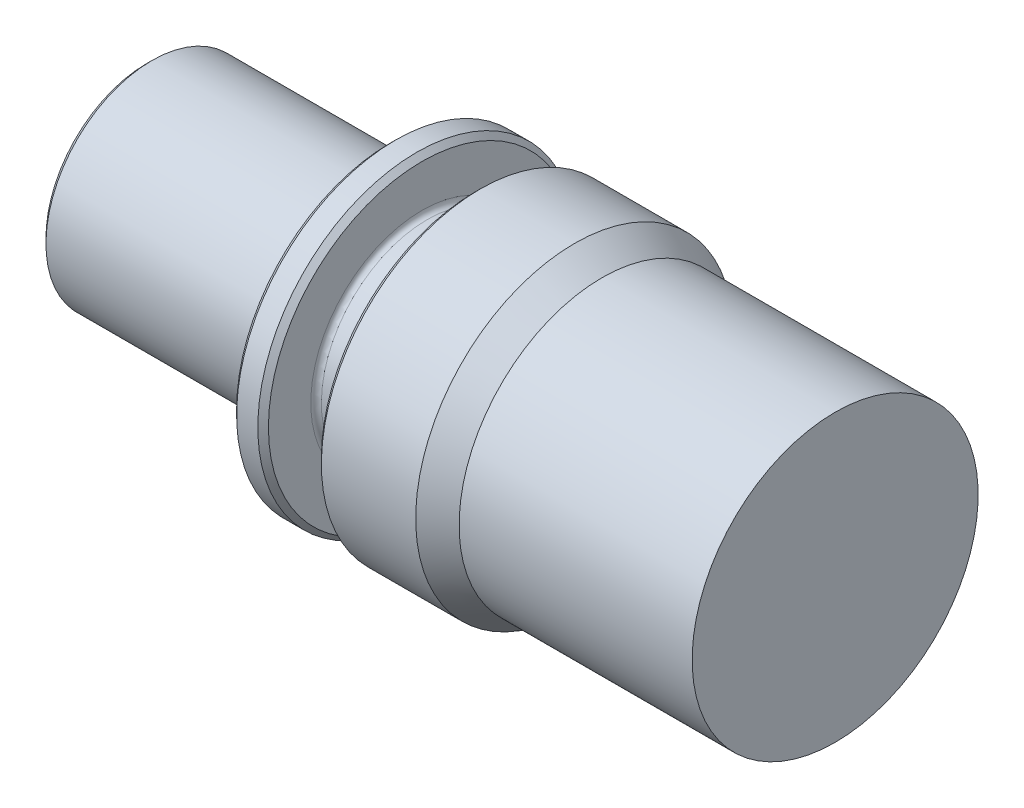
ISO-10303-21;
HEADER;
FILE_DESCRIPTION(('STEP AP214'),'2;1');
FILE_NAME('part.step','',(''),(''),'','','');
FILE_SCHEMA(('AUTOMOTIVE_DESIGN { 1 0 10303 214 1 1 1 1 }'));
ENDSEC;
DATA;
#1=APPLICATION_CONTEXT('core data for automotive mechanical design processes');
#2=APPLICATION_PROTOCOL_DEFINITION('international standard','automotive_design',2000,#1);
#3=PRODUCT_CONTEXT('',#1,'mechanical');
#4=PRODUCT('Part','Part','',(#3));
#5=PRODUCT_RELATED_PRODUCT_CATEGORY('part','',(#4));
#6=PRODUCT_DEFINITION_FORMATION('','',#4);
#7=PRODUCT_DEFINITION_CONTEXT('part definition',#1,'design');
#8=PRODUCT_DEFINITION('design','',#6,#7);
#9=PRODUCT_DEFINITION_SHAPE('','',#8);
#10=(LENGTH_UNIT() NAMED_UNIT(*) SI_UNIT(.MILLI.,.METRE.));
#11=(NAMED_UNIT(*) PLANE_ANGLE_UNIT() SI_UNIT($,.RADIAN.));
#12=(NAMED_UNIT(*) SI_UNIT($,.STERADIAN.) SOLID_ANGLE_UNIT());
#13=UNCERTAINTY_MEASURE_WITH_UNIT(LENGTH_MEASURE(1.E-05),#10,'distance_accuracy_value','');
#14=(GEOMETRIC_REPRESENTATION_CONTEXT(3) GLOBAL_UNCERTAINTY_ASSIGNED_CONTEXT((#13)) GLOBAL_UNIT_ASSIGNED_CONTEXT((#10,
#11,#12)) REPRESENTATION_CONTEXT('',''));
#15=CARTESIAN_POINT('',(0.,0.,0.));
#16=DIRECTION('',(0.,0.,1.));
#17=DIRECTION('',(1.,0.,0.));
#18=AXIS2_PLACEMENT_3D('',#15,#16,#17);
#19=CARTESIAN_POINT('',(28.,7.13999999999999,-7.14));
#20=DIRECTION('',(1.,0.,0.));
#21=DIRECTION('',(0.,0.,1.));
#22=AXIS2_PLACEMENT_3D('',#19,#20,#21);
#23=PLANE('',#22);
#24=CARTESIAN_POINT('',(28.,0.,0.));
#25=DIRECTION('',(1.,0.,0.));
#26=DIRECTION('',(0.,1.,0.));
#27=AXIS2_PLACEMENT_3D('',#24,#25,#26);
#28=CIRCLE('',#27,7.);
#29=CARTESIAN_POINT('',(28.,6.99999999999999,0.));
#30=VERTEX_POINT('',#29);
#31=EDGE_CURVE('E19',#30,#30,#28,.F.);
#32=ORIENTED_EDGE('',*,*,#31,.T.);
#33=EDGE_LOOP('',(#32));
#34=FACE_BOUND('',#33,.T.);
#35=ADVANCED_FACE('F15',(#34),#23,.F.);
#36=CARTESIAN_POINT('',(0.299999999999997,0.,0.));
#37=DIRECTION('',(1.,0.,0.));
#38=DIRECTION('',(0.,1.,0.));
#39=AXIS2_PLACEMENT_3D('',#36,#37,#38);
#40=CYLINDRICAL_SURFACE('',#39,7.);
#41=CARTESIAN_POINT('',(0.300000000134617,0.,0.));
#42=DIRECTION('',(-1.,0.,0.));
#43=DIRECTION('',(0.,0.,-1.));
#44=AXIS2_PLACEMENT_3D('',#41,#42,#43);
#45=CIRCLE('',#44,7.00000000013462);
#46=CARTESIAN_POINT('',(0.300000000134617,0.,-7.00000000013462));
#47=VERTEX_POINT('',#46);
#48=EDGE_CURVE('E74',#47,#47,#45,.T.);
#49=ORIENTED_EDGE('',*,*,#48,.T.);
#50=EDGE_LOOP('',(#49));
#51=FACE_BOUND('',#50,.T.);
#52=ORIENTED_EDGE('',*,*,#31,.F.);
#53=EDGE_LOOP('',(#52));
#54=FACE_BOUND('',#53,.T.);
#55=ADVANCED_FACE('F102',(#51,#54),#40,.F.);
#56=CARTESIAN_POINT('',(-1.34620288007314E-10,0.,0.));
#57=DIRECTION('',(-1.,0.,0.));
#58=DIRECTION('',(0.,-1.,0.));
#59=AXIS2_PLACEMENT_3D('',#56,#57,#58);
#60=CONICAL_SURFACE('',#59,7.29999999986538,0.785398162499996);
#61=CARTESIAN_POINT('',(-1.34620016956771E-10,0.,0.));
#62=DIRECTION('',(-1.,0.,0.));
#63=DIRECTION('',(0.,-1.,0.));
#64=AXIS2_PLACEMENT_3D('',#61,#62,#63);
#65=CIRCLE('',#64,7.29999999986538);
#66=CARTESIAN_POINT('',(-1.34621451121341E-10,-7.29999999986539,0.));
#67=VERTEX_POINT('',#66);
#68=EDGE_CURVE('E77',#67,#67,#65,.F.);
#69=ORIENTED_EDGE('',*,*,#68,.F.);
#70=EDGE_LOOP('',(#69));
#71=FACE_BOUND('',#70,.T.);
#72=ORIENTED_EDGE('',*,*,#48,.F.);
#73=EDGE_LOOP('',(#72));
#74=FACE_BOUND('',#73,.T.);
#75=ADVANCED_FACE('F99',(#71,#74),#60,.F.);
#76=CARTESIAN_POINT('',(0.,5.,0.));
#77=DIRECTION('',(-1.,0.,0.));
#78=DIRECTION('',(0.,0.,1.));
#79=AXIS2_PLACEMENT_3D('',#76,#77,#78);
#80=PLANE('',#79);
#81=ORIENTED_EDGE('',*,*,#68,.T.);
#82=EDGE_LOOP('',(#81));
#83=FACE_BOUND('',#82,.T.);
#84=CARTESIAN_POINT('',(-2.24363604951761E-10,0.,0.));
#85=DIRECTION('',(1.,0.,0.));
#86=DIRECTION('',(0.,1.,0.));
#87=AXIS2_PLACEMENT_3D('',#84,#85,#86);
#88=CIRCLE('',#87,9.50000000022436);
#89=CARTESIAN_POINT('',(-2.24361750966046E-10,9.50000000022436,0.));
#90=VERTEX_POINT('',#89);
#91=EDGE_CURVE('E71',#90,#90,#88,.T.);
#92=ORIENTED_EDGE('',*,*,#91,.F.);
#93=EDGE_LOOP('',(#92));
#94=FACE_BOUND('',#93,.T.);
#95=ADVANCED_FACE('F96',(#83,#94),#80,.T.);
#96=CARTESIAN_POINT('',(0.500000000224365,0.,0.));
#97=DIRECTION('',(1.,0.,0.));
#98=DIRECTION('',(0.,1.,0.));
#99=AXIS2_PLACEMENT_3D('',#96,#97,#98);
#100=CONICAL_SURFACE('',#99,9.99999999977564,0.785398162500002);
#101=CARTESIAN_POINT('',(0.5,0.,0.));
#102=DIRECTION('',(1.,0.,0.));
#103=DIRECTION('',(0.,1.,0.));
#104=AXIS2_PLACEMENT_3D('',#101,#102,#103);
#105=CIRCLE('',#104,10.);
#106=CARTESIAN_POINT('',(0.500000000000002,10.,0.));
#107=VERTEX_POINT('',#106);
#108=EDGE_CURVE('E67',#107,#107,#105,.T.);
#109=ORIENTED_EDGE('',*,*,#108,.F.);
#110=EDGE_LOOP('',(#109));
#111=FACE_BOUND('',#110,.T.);
#112=ORIENTED_EDGE('',*,*,#91,.T.);
#113=EDGE_LOOP('',(#112));
#114=FACE_BOUND('',#113,.T.);
#115=ADVANCED_FACE('F172',(#111,#114),#100,.T.);
#116=CARTESIAN_POINT('',(11.5000000000001,0.,0.));
#117=DIRECTION('',(1.,0.,0.));
#118=DIRECTION('',(0.,1.,0.));
#119=AXIS2_PLACEMENT_3D('',#116,#117,#118);
#120=CYLINDRICAL_SURFACE('',#119,10.);
#121=ORIENTED_EDGE('',*,*,#108,.T.);
#122=EDGE_LOOP('',(#121));
#123=FACE_BOUND('',#122,.T.);
#124=CARTESIAN_POINT('',(23.0000000000001,0.,0.));
#125=DIRECTION('',(1.,0.,0.));
#126=DIRECTION('',(0.,1.,0.));
#127=AXIS2_PLACEMENT_3D('',#124,#125,#126);
#128=CIRCLE('',#127,10.);
#129=CARTESIAN_POINT('',(23.0000000000001,10.,0.));
#130=VERTEX_POINT('',#129);
#131=EDGE_CURVE('E70',#130,#130,#128,.T.);
#132=ORIENTED_EDGE('',*,*,#131,.F.);
#133=EDGE_LOOP('',(#132));
#134=FACE_BOUND('',#133,.T.);
#135=ADVANCED_FACE('F168',(#123,#134),#120,.T.);
#136=CARTESIAN_POINT('',(23.0000000000001,12.5,0.));
#137=DIRECTION('',(-1.,0.,0.));
#138=DIRECTION('',(0.,0.,1.));
#139=AXIS2_PLACEMENT_3D('',#136,#137,#138);
#140=PLANE('',#139);
#141=ORIENTED_EDGE('',*,*,#131,.T.);
#142=EDGE_LOOP('',(#141));
#143=FACE_BOUND('',#142,.T.);
#144=CARTESIAN_POINT('',(22.9999999997758,0.,0.));
#145=DIRECTION('',(1.,0.,0.));
#146=DIRECTION('',(0.,1.,0.));
#147=AXIS2_PLACEMENT_3D('',#144,#145,#146);
#148=CIRCLE('',#147,14.5000000002244);
#149=CARTESIAN_POINT('',(22.9999999997758,14.5000000002244,0.));
#150=VERTEX_POINT('',#149);
#151=EDGE_CURVE('E64',#150,#150,#148,.T.);
#152=ORIENTED_EDGE('',*,*,#151,.F.);
#153=EDGE_LOOP('',(#152));
#154=FACE_BOUND('',#153,.T.);
#155=ADVANCED_FACE('F164',(#143,#154),#140,.T.);
#156=CARTESIAN_POINT('',(23.5000000002245,0.,0.));
#157=DIRECTION('',(1.,0.,0.));
#158=DIRECTION('',(0.,1.,0.));
#159=AXIS2_PLACEMENT_3D('',#156,#157,#158);
#160=CONICAL_SURFACE('',#159,14.9999999997757,0.7853981625);
#161=CARTESIAN_POINT('',(23.5000000000001,0.,0.));
#162=DIRECTION('',(1.,0.,0.));
#163=DIRECTION('',(0.,1.,0.));
#164=AXIS2_PLACEMENT_3D('',#161,#162,#163);
#165=CIRCLE('',#164,15.);
#166=CARTESIAN_POINT('',(23.5000000000001,15.,0.));
#167=VERTEX_POINT('',#166);
#168=EDGE_CURVE('E59',#167,#167,#165,.T.);
#169=ORIENTED_EDGE('',*,*,#168,.F.);
#170=EDGE_LOOP('',(#169));
#171=FACE_BOUND('',#170,.T.);
#172=ORIENTED_EDGE('',*,*,#151,.T.);
#173=EDGE_LOOP('',(#172));
#174=FACE_BOUND('',#173,.T.);
#175=ADVANCED_FACE('F160',(#171,#174),#160,.T.);
#176=CARTESIAN_POINT('',(24.5000000000001,0.,0.));
#177=DIRECTION('',(1.,0.,0.));
#178=DIRECTION('',(0.,1.,0.));
#179=AXIS2_PLACEMENT_3D('',#176,#177,#178);
#180=CYLINDRICAL_SURFACE('',#179,15.);
#181=CARTESIAN_POINT('',(25.4999999997757,0.,0.));
#182=DIRECTION('',(-1.,0.,0.));
#183=DIRECTION('',(0.,-1.,0.));
#184=AXIS2_PLACEMENT_3D('',#181,#182,#183);
#185=CIRCLE('',#184,14.9999999997756);
#186=CARTESIAN_POINT('',(25.4999999997757,-14.9999999997757,0.));
#187=VERTEX_POINT('',#186);
#188=EDGE_CURVE('E55',#187,#187,#185,.F.);
#189=ORIENTED_EDGE('',*,*,#188,.F.);
#190=EDGE_LOOP('',(#189));
#191=FACE_BOUND('',#190,.T.);
#192=ORIENTED_EDGE('',*,*,#168,.T.);
#193=EDGE_LOOP('',(#192));
#194=FACE_BOUND('',#193,.T.);
#195=ADVANCED_FACE('F156',(#191,#194),#180,.T.);
#196=CARTESIAN_POINT('',(25.4999999997757,0.,0.));
#197=DIRECTION('',(-1.,0.,0.));
#198=DIRECTION('',(0.,-1.,0.));
#199=AXIS2_PLACEMENT_3D('',#196,#197,#198);
#200=CONICAL_SURFACE('',#199,14.9999999997756,0.7853981625);
#201=CARTESIAN_POINT('',(26.0000000002245,0.,0.));
#202=DIRECTION('',(-1.,0.,0.));
#203=DIRECTION('',(0.,-1.,0.));
#204=AXIS2_PLACEMENT_3D('',#201,#202,#203);
#205=CIRCLE('',#204,14.5000000002244);
#206=CARTESIAN_POINT('',(26.0000000002245,-14.5000000002244,0.));
#207=VERTEX_POINT('',#206);
#208=EDGE_CURVE('E58',#207,#207,#205,.F.);
#209=ORIENTED_EDGE('',*,*,#208,.F.);
#210=EDGE_LOOP('',(#209));
#211=FACE_BOUND('',#210,.T.);
#212=ORIENTED_EDGE('',*,*,#188,.T.);
#213=EDGE_LOOP('',(#212));
#214=FACE_BOUND('',#213,.T.);
#215=ADVANCED_FACE('F152',(#211,#214),#200,.T.);
#216=CARTESIAN_POINT('',(26.0000000000001,12.5,0.));
#217=DIRECTION('',(1.,0.,0.));
#218=DIRECTION('',(0.,0.,-1.));
#219=AXIS2_PLACEMENT_3D('',#216,#217,#218);
#220=PLANE('',#219);
#221=CARTESIAN_POINT('',(26.0000000000001,0.,0.));
#222=DIRECTION('',(1.,0.,0.));
#223=DIRECTION('',(0.,1.,0.));
#224=AXIS2_PLACEMENT_3D('',#221,#222,#223);
#225=CIRCLE('',#224,10.5);
#226=CARTESIAN_POINT('',(26.0000000000001,10.5,0.));
#227=VERTEX_POINT('',#226);
#228=EDGE_CURVE('E52',#227,#227,#225,.T.);
#229=ORIENTED_EDGE('',*,*,#228,.F.);
#230=EDGE_LOOP('',(#229));
#231=FACE_BOUND('',#230,.T.);
#232=ORIENTED_EDGE('',*,*,#208,.T.);
#233=EDGE_LOOP('',(#232));
#234=FACE_BOUND('',#233,.T.);
#235=ADVANCED_FACE('F149',(#231,#234),#220,.T.);
#236=CARTESIAN_POINT('',(26.5000000000001,0.,0.));
#237=DIRECTION('',(1.,0.,0.));
#238=DIRECTION('',(0.,1.,0.));
#239=AXIS2_PLACEMENT_3D('',#236,#237,#238);
#240=TOROIDAL_SURFACE('',#239,10.5,0.500000000000004);
#241=CARTESIAN_POINT('',(26.5000000000001,0.,0.));
#242=DIRECTION('',(1.,0.,0.));
#243=DIRECTION('',(0.,1.,0.));
#244=AXIS2_PLACEMENT_3D('',#241,#242,#243);
#245=CIRCLE('',#244,10.);
#246=CARTESIAN_POINT('',(26.5000000000001,10.,0.));
#247=VERTEX_POINT('',#246);
#248=EDGE_CURVE('E47',#247,#247,#245,.T.);
#249=ORIENTED_EDGE('',*,*,#248,.F.);
#250=EDGE_LOOP('',(#249));
#251=FACE_BOUND('',#250,.T.);
#252=ORIENTED_EDGE('',*,*,#228,.T.);
#253=EDGE_LOOP('',(#252));
#254=FACE_BOUND('',#253,.T.);
#255=ADVANCED_FACE('F147',(#251,#254),#240,.F.);
#256=CARTESIAN_POINT('',(28.5000000000001,0.,0.));
#257=DIRECTION('',(1.,0.,0.));
#258=DIRECTION('',(0.,1.,0.));
#259=AXIS2_PLACEMENT_3D('',#256,#257,#258);
#260=CYLINDRICAL_SURFACE('',#259,10.);
#261=ORIENTED_EDGE('',*,*,#248,.T.);
#262=EDGE_LOOP('',(#261));
#263=FACE_BOUND('',#262,.T.);
#264=CARTESIAN_POINT('',(30.5000000000002,0.,0.));
#265=DIRECTION('',(1.,0.,0.));
#266=DIRECTION('',(0.,1.,0.));
#267=AXIS2_PLACEMENT_3D('',#264,#265,#266);
#268=CIRCLE('',#267,10.);
#269=CARTESIAN_POINT('',(30.5000000000002,10.,0.));
#270=VERTEX_POINT('',#269);
#271=EDGE_CURVE('E43',#270,#270,#268,.T.);
#272=ORIENTED_EDGE('',*,*,#271,.F.);
#273=EDGE_LOOP('',(#272));
#274=FACE_BOUND('',#273,.T.);
#275=ADVANCED_FACE('F144',(#263,#274),#260,.T.);
#276=CARTESIAN_POINT('',(30.5000000000002,0.,0.));
#277=DIRECTION('',(1.,0.,0.));
#278=DIRECTION('',(0.,1.,0.));
#279=AXIS2_PLACEMENT_3D('',#276,#277,#278);
#280=TOROIDAL_SURFACE('',#279,10.5,0.5);
#281=CARTESIAN_POINT('',(31.0000000000002,0.,0.));
#282=DIRECTION('',(1.,0.,0.));
#283=DIRECTION('',(0.,1.,0.));
#284=AXIS2_PLACEMENT_3D('',#281,#282,#283);
#285=CIRCLE('',#284,10.5);
#286=CARTESIAN_POINT('',(31.0000000000002,10.5,0.));
#287=VERTEX_POINT('',#286);
#288=EDGE_CURVE('E46',#287,#287,#285,.T.);
#289=ORIENTED_EDGE('',*,*,#288,.F.);
#290=EDGE_LOOP('',(#289));
#291=FACE_BOUND('',#290,.T.);
#292=ORIENTED_EDGE('',*,*,#271,.T.);
#293=EDGE_LOOP('',(#292));
#294=FACE_BOUND('',#293,.T.);
#295=ADVANCED_FACE('F17',(#291,#294),#280,.F.);
#296=CARTESIAN_POINT('',(31.0000000000002,12.5,0.));
#297=DIRECTION('',(-1.,0.,0.));
#298=DIRECTION('',(0.,0.,1.));
#299=AXIS2_PLACEMENT_3D('',#296,#297,#298);
#300=PLANE('',#299);
#301=ORIENTED_EDGE('',*,*,#288,.T.);
#302=EDGE_LOOP('',(#301));
#303=FACE_BOUND('',#302,.T.);
#304=CARTESIAN_POINT('',(30.9999999997758,0.,0.));
#305=DIRECTION('',(1.,0.,0.));
#306=DIRECTION('',(0.,0.,-1.));
#307=AXIS2_PLACEMENT_3D('',#304,#305,#306);
#308=CIRCLE('',#307,14.5000000002244);
#309=CARTESIAN_POINT('',(30.9999999997758,0.,-14.5000000002244));
#310=VERTEX_POINT('',#309);
#311=EDGE_CURVE('E40',#310,#310,#308,.T.);
#312=ORIENTED_EDGE('',*,*,#311,.F.);
#313=EDGE_LOOP('',(#312));
#314=FACE_BOUND('',#313,.T.);
#315=ADVANCED_FACE('F139',(#303,#314),#300,.T.);
#316=CARTESIAN_POINT('',(31.5000000002245,0.,0.));
#317=DIRECTION('',(1.,0.,0.));
#318=DIRECTION('',(0.,0.,-1.));
#319=AXIS2_PLACEMENT_3D('',#316,#317,#318);
#320=CONICAL_SURFACE('',#319,14.9999999997757,0.785398162500006);
#321=CARTESIAN_POINT('',(31.5000000000002,0.,0.));
#322=DIRECTION('',(1.,0.,0.));
#323=DIRECTION('',(0.,1.,0.));
#324=AXIS2_PLACEMENT_3D('',#321,#322,#323);
#325=CIRCLE('',#324,15.);
#326=CARTESIAN_POINT('',(31.5000000000002,15.,0.));
#327=VERTEX_POINT('',#326);
#328=EDGE_CURVE('E35',#327,#327,#325,.T.);
#329=ORIENTED_EDGE('',*,*,#328,.F.);
#330=EDGE_LOOP('',(#329));
#331=FACE_BOUND('',#330,.T.);
#332=ORIENTED_EDGE('',*,*,#311,.T.);
#333=EDGE_LOOP('',(#332));
#334=FACE_BOUND('',#333,.T.);
#335=ADVANCED_FACE('F135',(#331,#334),#320,.T.);
#336=CARTESIAN_POINT('',(35.7009618943236,0.,0.));
#337=DIRECTION('',(1.,0.,0.));
#338=DIRECTION('',(0.,1.,0.));
#339=AXIS2_PLACEMENT_3D('',#336,#337,#338);
#340=CYLINDRICAL_SURFACE('',#339,15.);
#341=ORIENTED_EDGE('',*,*,#328,.T.);
#342=EDGE_LOOP('',(#341));
#343=FACE_BOUND('',#342,.T.);
#344=CARTESIAN_POINT('',(40.4019237881982,0.,0.));
#345=DIRECTION('',(-1.,0.,0.));
#346=DIRECTION('',(0.,1.,0.));
#347=AXIS2_PLACEMENT_3D('',#344,#345,#346);
#348=CIRCLE('',#347,14.9999999992228);
#349=CARTESIAN_POINT('',(40.4019237881982,14.9999999992228,0.));
#350=VERTEX_POINT('',#349);
#351=EDGE_CURVE('E28',#350,#350,#348,.F.);
#352=ORIENTED_EDGE('',*,*,#351,.F.);
#353=EDGE_LOOP('',(#352));
#354=FACE_BOUND('',#353,.T.);
#355=ADVANCED_FACE('F131',(#343,#354),#340,.T.);
#356=CARTESIAN_POINT('',(65.0000000000001,6.74999999999999,0.));
#357=DIRECTION('',(1.,0.,0.));
#358=DIRECTION('',(0.,0.,-1.));
#359=AXIS2_PLACEMENT_3D('',#356,#357,#358);
#360=PLANE('',#359);
#361=CARTESIAN_POINT('',(65.0000000000003,0.,0.));
#362=DIRECTION('',(1.,0.,0.));
#363=DIRECTION('',(0.,1.,0.));
#364=AXIS2_PLACEMENT_3D('',#361,#362,#363);
#365=CIRCLE('',#364,13.5);
#366=CARTESIAN_POINT('',(65.0000000000003,13.5,0.));
#367=VERTEX_POINT('',#366);
#368=EDGE_CURVE('E23',#367,#367,#365,.F.);
#369=ORIENTED_EDGE('',*,*,#368,.F.);
#370=EDGE_LOOP('',(#369));
#371=FACE_BOUND('',#370,.T.);
#372=ADVANCED_FACE('F124',(#371),#360,.T.);
#373=CARTESIAN_POINT('',(40.4019237881982,0.,0.));
#374=DIRECTION('',(-1.,0.,0.));
#375=DIRECTION('',(0.,-1.,0.));
#376=AXIS2_PLACEMENT_3D('',#373,#374,#375);
#377=CONICAL_SURFACE('',#376,14.9999999992228,0.523598775);
#378=ORIENTED_EDGE('',*,*,#351,.T.);
#379=EDGE_LOOP('',(#378));
#380=FACE_BOUND('',#379,.T.);
#381=CARTESIAN_POINT('',(43.0000000000003,0.,0.));
#382=DIRECTION('',(1.,0.,0.));
#383=DIRECTION('',(0.,1.,0.));
#384=AXIS2_PLACEMENT_3D('',#381,#382,#383);
#385=CIRCLE('',#384,13.5);
#386=CARTESIAN_POINT('',(43.0000000000003,13.5,0.));
#387=VERTEX_POINT('',#386);
#388=EDGE_CURVE('E10',#387,#387,#385,.T.);
#389=ORIENTED_EDGE('',*,*,#388,.F.);
#390=EDGE_LOOP('',(#389));
#391=FACE_BOUND('',#390,.T.);
#392=ADVANCED_FACE('F119',(#380,#391),#377,.T.);
#393=CARTESIAN_POINT('',(44.8750000000003,0.,0.));
#394=DIRECTION('',(1.,0.,0.));
#395=DIRECTION('',(0.,1.,0.));
#396=AXIS2_PLACEMENT_3D('',#393,#394,#395);
#397=CYLINDRICAL_SURFACE('',#396,13.5);
#398=ORIENTED_EDGE('',*,*,#388,.T.);
#399=EDGE_LOOP('',(#398));
#400=FACE_BOUND('',#399,.T.);
#401=ORIENTED_EDGE('',*,*,#368,.T.);
#402=EDGE_LOOP('',(#401));
#403=FACE_BOUND('',#402,.T.);
#404=ADVANCED_FACE('F117',(#400,#403),#397,.T.);
#405=CLOSED_SHELL('',(#35,#55,#75,#95,#115,#135,#155,#175,#195,#215,#235,#255,#275,#295,#315,
#335,#355,#372,#392,#404));
#406=MANIFOLD_SOLID_BREP('B1',#405);
#407=ADVANCED_BREP_SHAPE_REPRESENTATION('',(#18,#406),#14);
#408=SHAPE_DEFINITION_REPRESENTATION(#9,#407);
ENDSEC;
END-ISO-10303-21;
